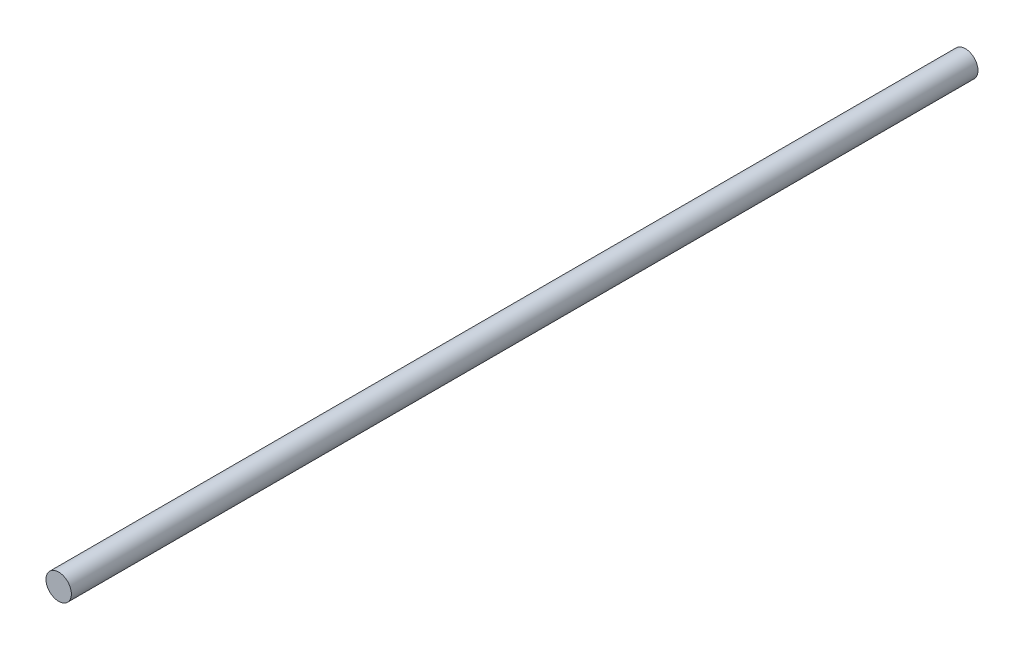
ISO-10303-21;
HEADER;
FILE_DESCRIPTION(('STEP AP214'),'2;1');
FILE_NAME('part.step','',(''),(''),'','','');
FILE_SCHEMA(('AUTOMOTIVE_DESIGN { 1 0 10303 214 1 1 1 1 }'));
ENDSEC;
DATA;
#1=APPLICATION_CONTEXT('core data for automotive mechanical design processes');
#2=APPLICATION_PROTOCOL_DEFINITION('international standard','automotive_design',2000,#1);
#3=PRODUCT_CONTEXT('',#1,'mechanical');
#4=PRODUCT('Part','Part','',(#3));
#5=PRODUCT_RELATED_PRODUCT_CATEGORY('part','',(#4));
#6=PRODUCT_DEFINITION_FORMATION('','',#4);
#7=PRODUCT_DEFINITION_CONTEXT('part definition',#1,'design');
#8=PRODUCT_DEFINITION('design','',#6,#7);
#9=PRODUCT_DEFINITION_SHAPE('','',#8);
#10=(LENGTH_UNIT() NAMED_UNIT(*) SI_UNIT(.MILLI.,.METRE.));
#11=(NAMED_UNIT(*) PLANE_ANGLE_UNIT() SI_UNIT($,.RADIAN.));
#12=(NAMED_UNIT(*) SI_UNIT($,.STERADIAN.) SOLID_ANGLE_UNIT());
#13=UNCERTAINTY_MEASURE_WITH_UNIT(LENGTH_MEASURE(1.E-05),#10,'distance_accuracy_value','');
#14=(GEOMETRIC_REPRESENTATION_CONTEXT(3) GLOBAL_UNCERTAINTY_ASSIGNED_CONTEXT((#13)) GLOBAL_UNIT_ASSIGNED_CONTEXT((#10,
#11,#12)) REPRESENTATION_CONTEXT('',''));
#15=CARTESIAN_POINT('',(0.,0.,0.));
#16=DIRECTION('',(0.,0.,1.));
#17=DIRECTION('',(1.,0.,0.));
#18=AXIS2_PLACEMENT_3D('',#15,#16,#17);
#19=CARTESIAN_POINT('',(0.,0.,250.));
#20=DIRECTION('',(0.,0.,-1.));
#21=DIRECTION('',(-1.,0.,0.));
#22=AXIS2_PLACEMENT_3D('',#19,#20,#21);
#23=CYLINDRICAL_SURFACE('',#22,3.5);
#24=CARTESIAN_POINT('',(0.,0.,250.));
#25=DIRECTION('',(0.,0.,1.));
#26=DIRECTION('',(1.,0.,0.));
#27=AXIS2_PLACEMENT_3D('',#24,#25,#26);
#28=CIRCLE('',#27,3.5);
#29=CARTESIAN_POINT('',(3.5,0.,250.));
#30=VERTEX_POINT('',#29);
#31=EDGE_CURVE('E10',#30,#30,#28,.T.);
#32=ORIENTED_EDGE('',*,*,#31,.F.);
#33=EDGE_LOOP('',(#32));
#34=FACE_BOUND('',#33,.T.);
#35=CARTESIAN_POINT('',(0.,0.,0.));
#36=DIRECTION('',(0.,0.,1.));
#37=DIRECTION('',(1.,0.,0.));
#38=AXIS2_PLACEMENT_3D('',#35,#36,#37);
#39=CIRCLE('',#38,3.5);
#40=CARTESIAN_POINT('',(3.5,0.,0.));
#41=VERTEX_POINT('',#40);
#42=EDGE_CURVE('E48',#41,#41,#39,.T.);
#43=ORIENTED_EDGE('',*,*,#42,.T.);
#44=EDGE_LOOP('',(#43));
#45=FACE_BOUND('',#44,.T.);
#46=ADVANCED_FACE('F45',(#34,#45),#23,.T.);
#47=CARTESIAN_POINT('',(0.,0.,250.));
#48=DIRECTION('',(0.,0.,1.));
#49=DIRECTION('',(1.,0.,0.));
#50=AXIS2_PLACEMENT_3D('',#47,#48,#49);
#51=PLANE('',#50);
#52=ORIENTED_EDGE('',*,*,#31,.T.);
#53=EDGE_LOOP('',(#52));
#54=FACE_BOUND('',#53,.T.);
#55=ADVANCED_FACE('F62',(#54),#51,.T.);
#56=CARTESIAN_POINT('',(0.,0.,0.));
#57=DIRECTION('',(0.,0.,1.));
#58=DIRECTION('',(1.,0.,0.));
#59=AXIS2_PLACEMENT_3D('',#56,#57,#58);
#60=PLANE('',#59);
#61=ORIENTED_EDGE('',*,*,#42,.F.);
#62=EDGE_LOOP('',(#61));
#63=FACE_BOUND('',#62,.T.);
#64=ADVANCED_FACE('F60',(#63),#60,.F.);
#65=CLOSED_SHELL('',(#46,#55,#64));
#66=MANIFOLD_SOLID_BREP('B2',#65);
#67=ADVANCED_BREP_SHAPE_REPRESENTATION('',(#18,#66),#14);
#68=SHAPE_DEFINITION_REPRESENTATION(#9,#67);
ENDSEC;
END-ISO-10303-21;
